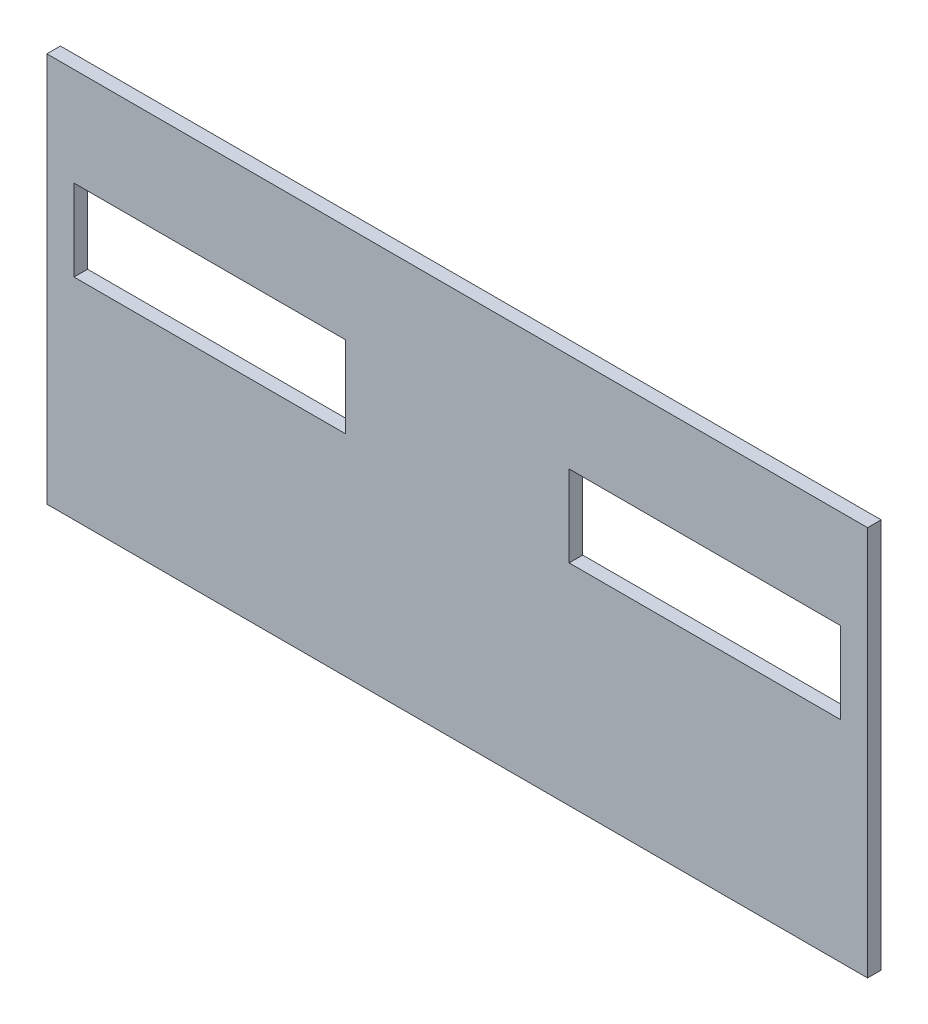
ISO-10303-21;
HEADER;
FILE_DESCRIPTION(('STEP AP214'),'2;1');
FILE_NAME('part.step','',(''),(''),'','','');
FILE_SCHEMA(('AUTOMOTIVE_DESIGN { 1 0 10303 214 1 1 1 1 }'));
ENDSEC;
DATA;
#1=APPLICATION_CONTEXT('core data for automotive mechanical design processes');
#2=APPLICATION_PROTOCOL_DEFINITION('international standard','automotive_design',2000,#1);
#3=PRODUCT_CONTEXT('',#1,'mechanical');
#4=PRODUCT('Part','Part','',(#3));
#5=PRODUCT_RELATED_PRODUCT_CATEGORY('part','',(#4));
#6=PRODUCT_DEFINITION_FORMATION('','',#4);
#7=PRODUCT_DEFINITION_CONTEXT('part definition',#1,'design');
#8=PRODUCT_DEFINITION('design','',#6,#7);
#9=PRODUCT_DEFINITION_SHAPE('','',#8);
#10=(LENGTH_UNIT() NAMED_UNIT(*) SI_UNIT(.MILLI.,.METRE.));
#11=(NAMED_UNIT(*) PLANE_ANGLE_UNIT() SI_UNIT($,.RADIAN.));
#12=(NAMED_UNIT(*) SI_UNIT($,.STERADIAN.) SOLID_ANGLE_UNIT());
#13=UNCERTAINTY_MEASURE_WITH_UNIT(LENGTH_MEASURE(1.E-05),#10,'distance_accuracy_value','');
#14=(GEOMETRIC_REPRESENTATION_CONTEXT(3) GLOBAL_UNCERTAINTY_ASSIGNED_CONTEXT((#13)) GLOBAL_UNIT_ASSIGNED_CONTEXT((#10,
#11,#12)) REPRESENTATION_CONTEXT('',''));
#15=CARTESIAN_POINT('',(0.,0.,0.));
#16=DIRECTION('',(0.,0.,1.));
#17=DIRECTION('',(1.,0.,0.));
#18=AXIS2_PLACEMENT_3D('',#15,#16,#17);
#19=CARTESIAN_POINT('',(0.,0.,4.));
#20=DIRECTION('',(0.,0.,1.));
#21=DIRECTION('',(1.,0.,0.));
#22=AXIS2_PLACEMENT_3D('',#19,#20,#21);
#23=PLANE('',#22);
#24=DIRECTION('',(0.,-1.,0.));
#25=VECTOR('',#24,1.);
#26=CARTESIAN_POINT('',(-99.0399274047187,66.2096188747731,4.));
#27=LINE('',#26,#25);
#28=CARTESIAN_POINT('',(-99.0399274047187,66.2096188747731,4.));
#29=VERTEX_POINT('',#28);
#30=CARTESIAN_POINT('',(-99.0399274047187,-48.7903811252269,4.));
#31=VERTEX_POINT('',#30);
#32=EDGE_CURVE('E224',#29,#31,#27,.T.);
#33=ORIENTED_EDGE('',*,*,#32,.T.);
#34=DIRECTION('',(1.,0.,0.));
#35=VECTOR('',#34,1.);
#36=CARTESIAN_POINT('',(-99.0399274047187,-48.7903811252269,4.));
#37=LINE('',#36,#35);
#38=CARTESIAN_POINT('',(142.960072595281,-48.7903811252269,4.));
#39=VERTEX_POINT('',#38);
#40=EDGE_CURVE('E228',#31,#39,#37,.T.);
#41=ORIENTED_EDGE('',*,*,#40,.T.);
#42=DIRECTION('',(0.,1.,0.));
#43=VECTOR('',#42,1.);
#44=CARTESIAN_POINT('',(142.960072595281,66.2096188747731,4.));
#45=LINE('',#44,#43);
#46=CARTESIAN_POINT('',(142.960072595281,66.2096188747731,4.));
#47=VERTEX_POINT('',#46);
#48=EDGE_CURVE('E232',#39,#47,#45,.T.);
#49=ORIENTED_EDGE('',*,*,#48,.T.);
#50=DIRECTION('',(-1.,0.,0.));
#51=VECTOR('',#50,1.);
#52=CARTESIAN_POINT('',(-99.0399274047187,66.2096188747731,4.));
#53=LINE('',#52,#51);
#54=EDGE_CURVE('E235',#47,#29,#53,.T.);
#55=ORIENTED_EDGE('',*,*,#54,.T.);
#56=EDGE_LOOP('',(#33,#41,#49,#55));
#57=FACE_BOUND('',#56,.T.);
#58=DIRECTION('',(1.,0.,0.));
#59=VECTOR('',#58,1.);
#60=CARTESIAN_POINT('',(-91.0399274047187,13.2096188747731,4.));
#61=LINE('',#60,#59);
#62=CARTESIAN_POINT('',(-91.0399274047187,13.2096188747731,4.));
#63=VERTEX_POINT('',#62);
#64=CARTESIAN_POINT('',(-11.0399274047187,13.2096188747731,4.));
#65=VERTEX_POINT('',#64);
#66=EDGE_CURVE('E184',#63,#65,#61,.T.);
#67=ORIENTED_EDGE('',*,*,#66,.F.);
#68=DIRECTION('',(0.,-1.,0.));
#69=VECTOR('',#68,1.);
#70=CARTESIAN_POINT('',(-91.0399274047187,37.2096188747731,4.));
#71=LINE('',#70,#69);
#72=CARTESIAN_POINT('',(-91.0399274047187,37.2096188747731,4.));
#73=VERTEX_POINT('',#72);
#74=EDGE_CURVE('E181',#73,#63,#71,.T.);
#75=ORIENTED_EDGE('',*,*,#74,.F.);
#76=DIRECTION('',(-1.,0.,0.));
#77=VECTOR('',#76,1.);
#78=CARTESIAN_POINT('',(-91.0399274047187,37.2096188747731,4.));
#79=LINE('',#78,#77);
#80=CARTESIAN_POINT('',(-11.0399274047187,37.2096188747731,4.));
#81=VERTEX_POINT('',#80);
#82=EDGE_CURVE('E192',#81,#73,#79,.T.);
#83=ORIENTED_EDGE('',*,*,#82,.F.);
#84=DIRECTION('',(0.,1.,0.));
#85=VECTOR('',#84,1.);
#86=CARTESIAN_POINT('',(-11.0399274047187,37.2096188747731,4.));
#87=LINE('',#86,#85);
#88=EDGE_CURVE('E188',#65,#81,#87,.T.);
#89=ORIENTED_EDGE('',*,*,#88,.F.);
#90=EDGE_LOOP('',(#67,#75,#83,#89));
#91=FACE_BOUND('',#90,.T.);
#92=DIRECTION('',(1.,0.,0.));
#93=VECTOR('',#92,1.);
#94=CARTESIAN_POINT('',(54.9600725952813,13.2096188747731,4.));
#95=LINE('',#94,#93);
#96=CARTESIAN_POINT('',(54.9600725952813,13.2096188747731,4.));
#97=VERTEX_POINT('',#96);
#98=CARTESIAN_POINT('',(134.960072595281,13.2096188747731,4.));
#99=VERTEX_POINT('',#98);
#100=EDGE_CURVE('E142',#97,#99,#95,.T.);
#101=ORIENTED_EDGE('',*,*,#100,.F.);
#102=DIRECTION('',(0.,-1.,0.));
#103=VECTOR('',#102,1.);
#104=CARTESIAN_POINT('',(54.9600725952813,37.2096188747731,4.));
#105=LINE('',#104,#103);
#106=CARTESIAN_POINT('',(54.9600725952813,37.2096188747731,4.));
#107=VERTEX_POINT('',#106);
#108=EDGE_CURVE('E133',#107,#97,#105,.T.);
#109=ORIENTED_EDGE('',*,*,#108,.F.);
#110=DIRECTION('',(-1.,0.,0.));
#111=VECTOR('',#110,1.);
#112=CARTESIAN_POINT('',(54.9600725952813,37.2096188747731,4.));
#113=LINE('',#112,#111);
#114=CARTESIAN_POINT('',(134.960072595281,37.2096188747731,4.));
#115=VERTEX_POINT('',#114);
#116=EDGE_CURVE('E159',#115,#107,#113,.T.);
#117=ORIENTED_EDGE('',*,*,#116,.F.);
#118=DIRECTION('',(0.,1.,0.));
#119=VECTOR('',#118,1.);
#120=CARTESIAN_POINT('',(134.960072595281,37.2096188747731,4.));
#121=LINE('',#120,#119);
#122=EDGE_CURVE('E155',#99,#115,#121,.T.);
#123=ORIENTED_EDGE('',*,*,#122,.F.);
#124=EDGE_LOOP('',(#101,#109,#117,#123));
#125=FACE_BOUND('',#124,.T.);
#126=ADVANCED_FACE('F43',(#57,#91,#125),#23,.T.);
#127=CARTESIAN_POINT('',(0.,0.,0.));
#128=DIRECTION('',(0.,0.,1.));
#129=DIRECTION('',(1.,0.,0.));
#130=AXIS2_PLACEMENT_3D('',#127,#128,#129);
#131=PLANE('',#130);
#132=DIRECTION('',(0.,-1.,0.));
#133=VECTOR('',#132,1.);
#134=CARTESIAN_POINT('',(-91.0399274047187,37.2096188747731,0.));
#135=LINE('',#134,#133);
#136=CARTESIAN_POINT('',(-91.0399274047187,37.2096188747731,0.));
#137=VERTEX_POINT('',#136);
#138=CARTESIAN_POINT('',(-91.0399274047187,13.2096188747731,0.));
#139=VERTEX_POINT('',#138);
#140=EDGE_CURVE('E151',#137,#139,#135,.T.);
#141=ORIENTED_EDGE('',*,*,#140,.T.);
#142=DIRECTION('',(1.,0.,0.));
#143=VECTOR('',#142,1.);
#144=CARTESIAN_POINT('',(-91.0399274047187,13.2096188747731,0.));
#145=LINE('',#144,#143);
#146=CARTESIAN_POINT('',(-11.0399274047187,13.2096188747731,0.));
#147=VERTEX_POINT('',#146);
#148=EDGE_CURVE('E199',#139,#147,#145,.T.);
#149=ORIENTED_EDGE('',*,*,#148,.T.);
#150=DIRECTION('',(0.,1.,0.));
#151=VECTOR('',#150,1.);
#152=CARTESIAN_POINT('',(-11.0399274047187,37.2096188747731,0.));
#153=LINE('',#152,#151);
#154=CARTESIAN_POINT('',(-11.0399274047187,37.2096188747731,0.));
#155=VERTEX_POINT('',#154);
#156=EDGE_CURVE('E203',#147,#155,#153,.T.);
#157=ORIENTED_EDGE('',*,*,#156,.T.);
#158=DIRECTION('',(-1.,0.,0.));
#159=VECTOR('',#158,1.);
#160=CARTESIAN_POINT('',(-91.0399274047187,37.2096188747731,0.));
#161=LINE('',#160,#159);
#162=EDGE_CURVE('E185',#155,#137,#161,.T.);
#163=ORIENTED_EDGE('',*,*,#162,.T.);
#164=EDGE_LOOP('',(#141,#149,#157,#163));
#165=FACE_BOUND('',#164,.T.);
#166=DIRECTION('',(0.,-1.,0.));
#167=VECTOR('',#166,1.);
#168=CARTESIAN_POINT('',(-99.0399274047187,66.2096188747731,0.));
#169=LINE('',#168,#167);
#170=CARTESIAN_POINT('',(-99.0399274047187,66.2096188747731,0.));
#171=VERTEX_POINT('',#170);
#172=CARTESIAN_POINT('',(-99.0399274047187,-48.7903811252269,0.));
#173=VERTEX_POINT('',#172);
#174=EDGE_CURVE('E223',#171,#173,#169,.T.);
#175=ORIENTED_EDGE('',*,*,#174,.F.);
#176=DIRECTION('',(-1.,0.,0.));
#177=VECTOR('',#176,1.);
#178=CARTESIAN_POINT('',(-99.0399274047187,66.2096188747731,0.));
#179=LINE('',#178,#177);
#180=CARTESIAN_POINT('',(142.960072595281,66.2096188747731,0.));
#181=VERTEX_POINT('',#180);
#182=EDGE_CURVE('E229',#181,#171,#179,.T.);
#183=ORIENTED_EDGE('',*,*,#182,.F.);
#184=DIRECTION('',(0.,1.,0.));
#185=VECTOR('',#184,1.);
#186=CARTESIAN_POINT('',(142.960072595281,66.2096188747731,0.));
#187=LINE('',#186,#185);
#188=CARTESIAN_POINT('',(142.960072595281,-48.7903811252269,0.));
#189=VERTEX_POINT('',#188);
#190=EDGE_CURVE('E245',#189,#181,#187,.T.);
#191=ORIENTED_EDGE('',*,*,#190,.F.);
#192=DIRECTION('',(1.,0.,0.));
#193=VECTOR('',#192,1.);
#194=CARTESIAN_POINT('',(-99.0399274047187,-48.7903811252269,0.));
#195=LINE('',#194,#193);
#196=EDGE_CURVE('E242',#173,#189,#195,.T.);
#197=ORIENTED_EDGE('',*,*,#196,.F.);
#198=EDGE_LOOP('',(#175,#183,#191,#197));
#199=FACE_BOUND('',#198,.T.);
#200=DIRECTION('',(0.,-1.,0.));
#201=VECTOR('',#200,1.);
#202=CARTESIAN_POINT('',(54.9600725952813,37.2096188747731,0.));
#203=LINE('',#202,#201);
#204=CARTESIAN_POINT('',(54.9600725952813,37.2096188747731,0.));
#205=VERTEX_POINT('',#204);
#206=CARTESIAN_POINT('',(54.9600725952813,13.2096188747731,0.));
#207=VERTEX_POINT('',#206);
#208=EDGE_CURVE('E67',#205,#207,#203,.T.);
#209=ORIENTED_EDGE('',*,*,#208,.T.);
#210=DIRECTION('',(1.,0.,0.));
#211=VECTOR('',#210,1.);
#212=CARTESIAN_POINT('',(54.9600725952813,13.2096188747731,0.));
#213=LINE('',#212,#211);
#214=CARTESIAN_POINT('',(134.960072595281,13.2096188747731,0.));
#215=VERTEX_POINT('',#214);
#216=EDGE_CURVE('E149',#207,#215,#213,.T.);
#217=ORIENTED_EDGE('',*,*,#216,.T.);
#218=DIRECTION('',(0.,1.,0.));
#219=VECTOR('',#218,1.);
#220=CARTESIAN_POINT('',(134.960072595281,37.2096188747731,0.));
#221=LINE('',#220,#219);
#222=CARTESIAN_POINT('',(134.960072595281,37.2096188747731,0.));
#223=VERTEX_POINT('',#222);
#224=EDGE_CURVE('E168',#215,#223,#221,.T.);
#225=ORIENTED_EDGE('',*,*,#224,.T.);
#226=DIRECTION('',(-1.,0.,0.));
#227=VECTOR('',#226,1.);
#228=CARTESIAN_POINT('',(54.9600725952813,37.2096188747731,0.));
#229=LINE('',#228,#227);
#230=EDGE_CURVE('E143',#223,#205,#229,.T.);
#231=ORIENTED_EDGE('',*,*,#230,.T.);
#232=EDGE_LOOP('',(#209,#217,#225,#231));
#233=FACE_BOUND('',#232,.T.);
#234=ADVANCED_FACE('F268',(#165,#199,#233),#131,.F.);
#235=CARTESIAN_POINT('',(-99.0399274047187,66.2096188747731,4.));
#236=DIRECTION('',(1.,0.,0.));
#237=DIRECTION('',(0.,1.,0.));
#238=AXIS2_PLACEMENT_3D('',#235,#236,#237);
#239=PLANE('',#238);
#240=ORIENTED_EDGE('',*,*,#174,.T.);
#241=DIRECTION('',(0.,0.,-1.));
#242=VECTOR('',#241,1.);
#243=CARTESIAN_POINT('',(-99.0399274047187,-48.7903811252269,4.));
#244=LINE('',#243,#242);
#245=EDGE_CURVE('E11',#31,#173,#244,.T.);
#246=ORIENTED_EDGE('',*,*,#245,.F.);
#247=ORIENTED_EDGE('',*,*,#32,.F.);
#248=DIRECTION('',(0.,0.,-1.));
#249=VECTOR('',#248,1.);
#250=CARTESIAN_POINT('',(-99.0399274047187,66.2096188747731,4.));
#251=LINE('',#250,#249);
#252=EDGE_CURVE('E238',#29,#171,#251,.T.);
#253=ORIENTED_EDGE('',*,*,#252,.T.);
#254=EDGE_LOOP('',(#240,#246,#247,#253));
#255=FACE_BOUND('',#254,.T.);
#256=ADVANCED_FACE('F45',(#255),#239,.F.);
#257=CARTESIAN_POINT('',(-99.0399274047187,-48.7903811252269,4.));
#258=DIRECTION('',(0.,1.,0.));
#259=DIRECTION('',(0.,0.,1.));
#260=AXIS2_PLACEMENT_3D('',#257,#258,#259);
#261=PLANE('',#260);
#262=ORIENTED_EDGE('',*,*,#196,.T.);
#263=DIRECTION('',(0.,0.,-1.));
#264=VECTOR('',#263,1.);
#265=CARTESIAN_POINT('',(142.960072595281,-48.7903811252269,4.));
#266=LINE('',#265,#264);
#267=EDGE_CURVE('E52',#39,#189,#266,.T.);
#268=ORIENTED_EDGE('',*,*,#267,.F.);
#269=ORIENTED_EDGE('',*,*,#40,.F.);
#270=ORIENTED_EDGE('',*,*,#245,.T.);
#271=EDGE_LOOP('',(#262,#268,#269,#270));
#272=FACE_BOUND('',#271,.T.);
#273=ADVANCED_FACE('F279',(#272),#261,.F.);
#274=CARTESIAN_POINT('',(142.960072595281,66.2096188747731,4.));
#275=DIRECTION('',(-1.,0.,0.));
#276=DIRECTION('',(0.,-1.,0.));
#277=AXIS2_PLACEMENT_3D('',#274,#275,#276);
#278=PLANE('',#277);
#279=ORIENTED_EDGE('',*,*,#190,.T.);
#280=DIRECTION('',(0.,0.,-1.));
#281=VECTOR('',#280,1.);
#282=CARTESIAN_POINT('',(142.960072595281,66.2096188747731,4.));
#283=LINE('',#282,#281);
#284=EDGE_CURVE('E253',#47,#181,#283,.T.);
#285=ORIENTED_EDGE('',*,*,#284,.F.);
#286=ORIENTED_EDGE('',*,*,#48,.F.);
#287=ORIENTED_EDGE('',*,*,#267,.T.);
#288=EDGE_LOOP('',(#279,#285,#286,#287));
#289=FACE_BOUND('',#288,.T.);
#290=ADVANCED_FACE('F262',(#289),#278,.F.);
#291=CARTESIAN_POINT('',(-99.0399274047187,66.2096188747731,4.));
#292=DIRECTION('',(0.,-1.,0.));
#293=DIRECTION('',(0.,0.,-1.));
#294=AXIS2_PLACEMENT_3D('',#291,#292,#293);
#295=PLANE('',#294);
#296=ORIENTED_EDGE('',*,*,#182,.T.);
#297=ORIENTED_EDGE('',*,*,#252,.F.);
#298=ORIENTED_EDGE('',*,*,#54,.F.);
#299=ORIENTED_EDGE('',*,*,#284,.T.);
#300=EDGE_LOOP('',(#296,#297,#298,#299));
#301=FACE_BOUND('',#300,.T.);
#302=ADVANCED_FACE('F272',(#301),#295,.F.);
#303=CARTESIAN_POINT('',(-91.0399274047187,37.2096188747731,4.));
#304=DIRECTION('',(1.,0.,0.));
#305=DIRECTION('',(0.,1.,0.));
#306=AXIS2_PLACEMENT_3D('',#303,#304,#305);
#307=PLANE('',#306);
#308=ORIENTED_EDGE('',*,*,#140,.F.);
#309=DIRECTION('',(0.,0.,-1.));
#310=VECTOR('',#309,1.);
#311=CARTESIAN_POINT('',(-91.0399274047187,37.2096188747731,4.));
#312=LINE('',#311,#310);
#313=EDGE_CURVE('E195',#73,#137,#312,.T.);
#314=ORIENTED_EDGE('',*,*,#313,.F.);
#315=ORIENTED_EDGE('',*,*,#74,.T.);
#316=DIRECTION('',(0.,0.,-1.));
#317=VECTOR('',#316,1.);
#318=CARTESIAN_POINT('',(-91.0399274047187,13.2096188747731,4.));
#319=LINE('',#318,#317);
#320=EDGE_CURVE('E219',#63,#139,#319,.T.);
#321=ORIENTED_EDGE('',*,*,#320,.T.);
#322=EDGE_LOOP('',(#308,#314,#315,#321));
#323=FACE_BOUND('',#322,.T.);
#324=ADVANCED_FACE('F294',(#323),#307,.T.);
#325=CARTESIAN_POINT('',(-91.0399274047187,13.2096188747731,4.));
#326=DIRECTION('',(0.,1.,0.));
#327=DIRECTION('',(0.,0.,1.));
#328=AXIS2_PLACEMENT_3D('',#325,#326,#327);
#329=PLANE('',#328);
#330=ORIENTED_EDGE('',*,*,#148,.F.);
#331=ORIENTED_EDGE('',*,*,#320,.F.);
#332=ORIENTED_EDGE('',*,*,#66,.T.);
#333=DIRECTION('',(0.,0.,-1.));
#334=VECTOR('',#333,1.);
#335=CARTESIAN_POINT('',(-11.0399274047187,13.2096188747731,4.));
#336=LINE('',#335,#334);
#337=EDGE_CURVE('E216',#65,#147,#336,.T.);
#338=ORIENTED_EDGE('',*,*,#337,.T.);
#339=EDGE_LOOP('',(#330,#331,#332,#338));
#340=FACE_BOUND('',#339,.T.);
#341=ADVANCED_FACE('F301',(#340),#329,.T.);
#342=CARTESIAN_POINT('',(-11.0399274047187,37.2096188747731,4.));
#343=DIRECTION('',(-1.,0.,0.));
#344=DIRECTION('',(0.,0.,1.));
#345=AXIS2_PLACEMENT_3D('',#342,#343,#344);
#346=PLANE('',#345);
#347=ORIENTED_EDGE('',*,*,#156,.F.);
#348=ORIENTED_EDGE('',*,*,#337,.F.);
#349=ORIENTED_EDGE('',*,*,#88,.T.);
#350=DIRECTION('',(0.,0.,-1.));
#351=VECTOR('',#350,1.);
#352=CARTESIAN_POINT('',(-11.0399274047187,37.2096188747731,4.));
#353=LINE('',#352,#351);
#354=EDGE_CURVE('E213',#81,#155,#353,.T.);
#355=ORIENTED_EDGE('',*,*,#354,.T.);
#356=EDGE_LOOP('',(#347,#348,#349,#355));
#357=FACE_BOUND('',#356,.T.);
#358=ADVANCED_FACE('F306',(#357),#346,.T.);
#359=CARTESIAN_POINT('',(-91.0399274047187,37.2096188747731,4.));
#360=DIRECTION('',(0.,-1.,0.));
#361=DIRECTION('',(0.,0.,-1.));
#362=AXIS2_PLACEMENT_3D('',#359,#360,#361);
#363=PLANE('',#362);
#364=ORIENTED_EDGE('',*,*,#162,.F.);
#365=ORIENTED_EDGE('',*,*,#354,.F.);
#366=ORIENTED_EDGE('',*,*,#82,.T.);
#367=ORIENTED_EDGE('',*,*,#313,.T.);
#368=EDGE_LOOP('',(#364,#365,#366,#367));
#369=FACE_BOUND('',#368,.T.);
#370=ADVANCED_FACE('F313',(#369),#363,.T.);
#371=CARTESIAN_POINT('',(54.9600725952813,37.2096188747731,4.));
#372=DIRECTION('',(1.,0.,0.));
#373=DIRECTION('',(0.,0.,-1.));
#374=AXIS2_PLACEMENT_3D('',#371,#372,#373);
#375=PLANE('',#374);
#376=ORIENTED_EDGE('',*,*,#208,.F.);
#377=DIRECTION('',(0.,0.,-1.));
#378=VECTOR('',#377,1.);
#379=CARTESIAN_POINT('',(54.9600725952813,37.2096188747731,4.));
#380=LINE('',#379,#378);
#381=EDGE_CURVE('E137',#107,#205,#380,.T.);
#382=ORIENTED_EDGE('',*,*,#381,.F.);
#383=ORIENTED_EDGE('',*,*,#108,.T.);
#384=DIRECTION('',(0.,0.,-1.));
#385=VECTOR('',#384,1.);
#386=CARTESIAN_POINT('',(54.9600725952813,13.2096188747731,4.));
#387=LINE('',#386,#385);
#388=EDGE_CURVE('E136',#97,#207,#387,.T.);
#389=ORIENTED_EDGE('',*,*,#388,.T.);
#390=EDGE_LOOP('',(#376,#382,#383,#389));
#391=FACE_BOUND('',#390,.T.);
#392=ADVANCED_FACE('F135',(#391),#375,.T.);
#393=CARTESIAN_POINT('',(54.9600725952813,13.2096188747731,4.));
#394=DIRECTION('',(0.,1.,0.));
#395=DIRECTION('',(0.,0.,1.));
#396=AXIS2_PLACEMENT_3D('',#393,#394,#395);
#397=PLANE('',#396);
#398=ORIENTED_EDGE('',*,*,#216,.F.);
#399=ORIENTED_EDGE('',*,*,#388,.F.);
#400=ORIENTED_EDGE('',*,*,#100,.T.);
#401=DIRECTION('',(0.,0.,-1.));
#402=VECTOR('',#401,1.);
#403=CARTESIAN_POINT('',(134.960072595281,13.2096188747731,4.));
#404=LINE('',#403,#402);
#405=EDGE_CURVE('E152',#99,#215,#404,.T.);
#406=ORIENTED_EDGE('',*,*,#405,.T.);
#407=EDGE_LOOP('',(#398,#399,#400,#406));
#408=FACE_BOUND('',#407,.T.);
#409=ADVANCED_FACE('F146',(#408),#397,.T.);
#410=CARTESIAN_POINT('',(134.960072595281,37.2096188747731,4.));
#411=DIRECTION('',(-1.,0.,0.));
#412=DIRECTION('',(0.,0.,1.));
#413=AXIS2_PLACEMENT_3D('',#410,#411,#412);
#414=PLANE('',#413);
#415=ORIENTED_EDGE('',*,*,#224,.F.);
#416=ORIENTED_EDGE('',*,*,#405,.F.);
#417=ORIENTED_EDGE('',*,*,#122,.T.);
#418=DIRECTION('',(0.,0.,-1.));
#419=VECTOR('',#418,1.);
#420=CARTESIAN_POINT('',(134.960072595281,37.2096188747731,4.));
#421=LINE('',#420,#419);
#422=EDGE_CURVE('E59',#115,#223,#421,.T.);
#423=ORIENTED_EDGE('',*,*,#422,.T.);
#424=EDGE_LOOP('',(#415,#416,#417,#423));
#425=FACE_BOUND('',#424,.T.);
#426=ADVANCED_FACE('F331',(#425),#414,.T.);
#427=CARTESIAN_POINT('',(54.9600725952813,37.2096188747731,4.));
#428=DIRECTION('',(0.,-1.,0.));
#429=DIRECTION('',(0.,0.,-1.));
#430=AXIS2_PLACEMENT_3D('',#427,#428,#429);
#431=PLANE('',#430);
#432=ORIENTED_EDGE('',*,*,#230,.F.);
#433=ORIENTED_EDGE('',*,*,#422,.F.);
#434=ORIENTED_EDGE('',*,*,#116,.T.);
#435=ORIENTED_EDGE('',*,*,#381,.T.);
#436=EDGE_LOOP('',(#432,#433,#434,#435));
#437=FACE_BOUND('',#436,.T.);
#438=ADVANCED_FACE('F334',(#437),#431,.T.);
#439=CLOSED_SHELL('',(#126,#234,#256,#273,#290,#302,#324,#341,#358,#370,#392,#409,#426,#438));
#440=MANIFOLD_SOLID_BREP('B2',#439);
#441=ADVANCED_BREP_SHAPE_REPRESENTATION('',(#18,#440),#14);
#442=SHAPE_DEFINITION_REPRESENTATION(#9,#441);
ENDSEC;
END-ISO-10303-21;
